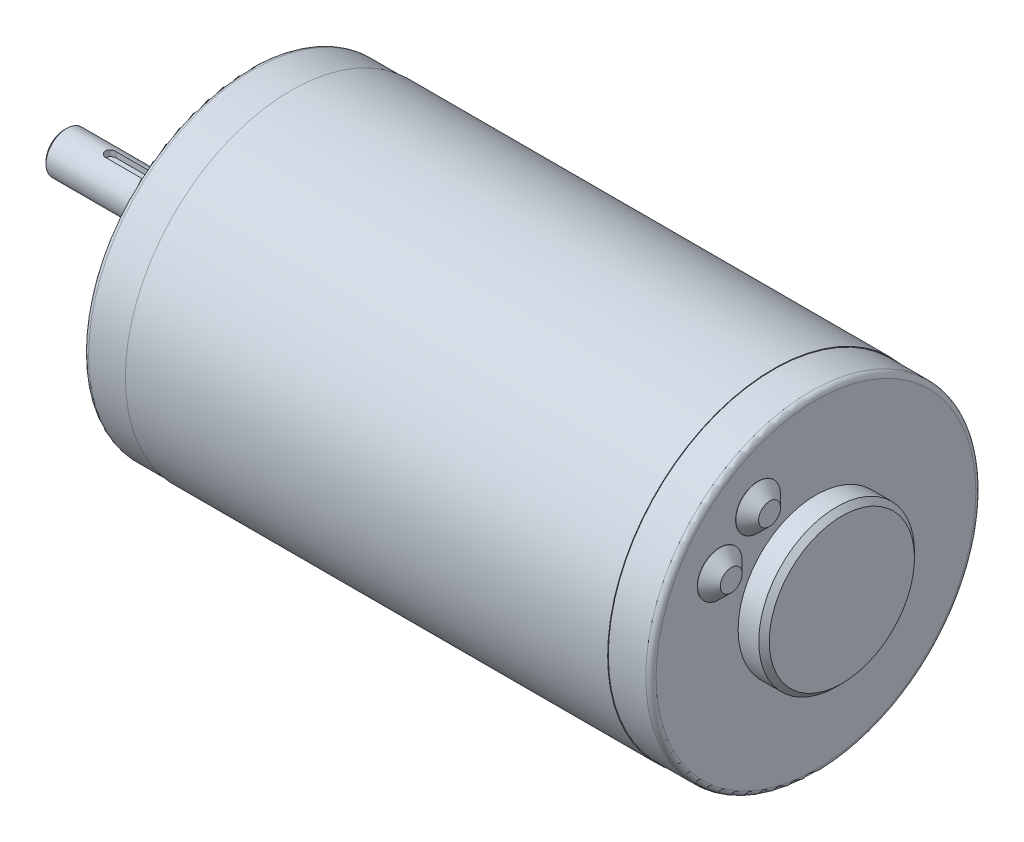
ISO-10303-21;
HEADER;
FILE_DESCRIPTION(('STEP AP214'),'2;1');
FILE_NAME('part.step','',(''),(''),'','','');
FILE_SCHEMA(('AUTOMOTIVE_DESIGN { 1 0 10303 214 1 1 1 1 }'));
ENDSEC;
DATA;
#1=APPLICATION_CONTEXT('core data for automotive mechanical design processes');
#2=APPLICATION_PROTOCOL_DEFINITION('international standard','automotive_design',2000,#1);
#3=PRODUCT_CONTEXT('',#1,'mechanical');
#4=PRODUCT('Part','Part','',(#3));
#5=PRODUCT_RELATED_PRODUCT_CATEGORY('part','',(#4));
#6=PRODUCT_DEFINITION_FORMATION('','',#4);
#7=PRODUCT_DEFINITION_CONTEXT('part definition',#1,'design');
#8=PRODUCT_DEFINITION('design','',#6,#7);
#9=PRODUCT_DEFINITION_SHAPE('','',#8);
#10=(LENGTH_UNIT() NAMED_UNIT(*) SI_UNIT(.MILLI.,.METRE.));
#11=(NAMED_UNIT(*) PLANE_ANGLE_UNIT() SI_UNIT($,.RADIAN.));
#12=(NAMED_UNIT(*) SI_UNIT($,.STERADIAN.) SOLID_ANGLE_UNIT());
#13=UNCERTAINTY_MEASURE_WITH_UNIT(LENGTH_MEASURE(1.E-05),#10,'distance_accuracy_value','');
#14=(GEOMETRIC_REPRESENTATION_CONTEXT(3) GLOBAL_UNCERTAINTY_ASSIGNED_CONTEXT((#13)) GLOBAL_UNIT_ASSIGNED_CONTEXT((#10,
#11,#12)) REPRESENTATION_CONTEXT('',''));
#15=CARTESIAN_POINT('',(0.,0.,0.));
#16=DIRECTION('',(0.,0.,1.));
#17=DIRECTION('',(1.,0.,0.));
#18=AXIS2_PLACEMENT_3D('',#15,#16,#17);
#19=CARTESIAN_POINT('',(-27.6,2.79999999999999,1.));
#20=DIRECTION('',(0.,-1.,0.));
#21=DIRECTION('',(0.,0.,1.));
#22=AXIS2_PLACEMENT_3D('',#19,#20,#21);
#23=PLANE('',#22);
#24=CARTESIAN_POINT('',(-7.1,2.79999999999999,0.));
#25=DIRECTION('',(0.,-1.,0.));
#26=DIRECTION('',(0.,0.,-1.));
#27=AXIS2_PLACEMENT_3D('',#24,#25,#26);
#28=CIRCLE('',#27,1.);
#29=CARTESIAN_POINT('',(-7.1,2.79999999999999,-1.));
#30=VERTEX_POINT('',#29);
#31=CARTESIAN_POINT('',(-7.1,2.79999999999999,1.));
#32=VERTEX_POINT('',#31);
#33=EDGE_CURVE('E109',#30,#32,#28,.T.);
#34=ORIENTED_EDGE('',*,*,#33,.F.);
#35=DIRECTION('',(1.,0.,0.));
#36=VECTOR('',#35,1.);
#37=CARTESIAN_POINT('',(-27.6,2.79999999999999,-1.));
#38=LINE('',#37,#36);
#39=CARTESIAN_POINT('',(-26.6,2.79999999999999,-1.));
#40=VERTEX_POINT('',#39);
#41=EDGE_CURVE('E121',#40,#30,#38,.T.);
#42=ORIENTED_EDGE('',*,*,#41,.F.);
#43=CARTESIAN_POINT('',(-26.6,2.79999999999999,0.));
#44=DIRECTION('',(0.,1.,0.));
#45=DIRECTION('',(0.,0.,1.));
#46=AXIS2_PLACEMENT_3D('',#43,#44,#45);
#47=CIRCLE('',#46,1.);
#48=CARTESIAN_POINT('',(-26.6,2.79999999999999,1.));
#49=VERTEX_POINT('',#48);
#50=EDGE_CURVE('E103',#49,#40,#47,.F.);
#51=ORIENTED_EDGE('',*,*,#50,.F.);
#52=DIRECTION('',(1.,0.,0.));
#53=VECTOR('',#52,1.);
#54=CARTESIAN_POINT('',(-27.6,2.79999999999999,1.));
#55=LINE('',#54,#53);
#56=EDGE_CURVE('E110',#49,#32,#55,.T.);
#57=ORIENTED_EDGE('',*,*,#56,.T.);
#58=EDGE_LOOP('',(#34,#42,#51,#57));
#59=FACE_BOUND('',#58,.T.);
#60=ADVANCED_FACE('F39',(#59),#23,.F.);
#61=CARTESIAN_POINT('',(-35.6,0.,0.));
#62=DIRECTION('',(-1.,0.,0.));
#63=DIRECTION('',(0.,0.,-1.));
#64=AXIS2_PLACEMENT_3D('',#61,#62,#63);
#65=PLANE('',#64);
#66=CARTESIAN_POINT('',(-35.6000000000449,0.,0.));
#67=DIRECTION('',(-1.,0.,0.));
#68=DIRECTION('',(0.,0.,1.));
#69=AXIS2_PLACEMENT_3D('',#66,#67,#68);
#70=CIRCLE('',#69,3.49999999997408);
#71=CARTESIAN_POINT('',(-35.6000000000449,0.,3.49999999997408));
#72=VERTEX_POINT('',#71);
#73=EDGE_CURVE('E260',#72,#72,#70,.T.);
#74=ORIENTED_EDGE('',*,*,#73,.T.);
#75=EDGE_LOOP('',(#74));
#76=FACE_BOUND('',#75,.T.);
#77=ADVANCED_FACE('F328',(#76),#65,.T.);
#78=CARTESIAN_POINT('',(-26.6,3.87298334620741,0.));
#79=DIRECTION('',(0.,-1.,0.));
#80=DIRECTION('',(0.,0.,1.));
#81=AXIS2_PLACEMENT_3D('',#78,#79,#80);
#82=CYLINDRICAL_SURFACE('',#81,1.);
#83=CARTESIAN_POINT('',(-26.6,3.87298334620741,-1.));
#84=CARTESIAN_POINT('',(-26.6276629851065,3.87298148580177,-1.00000033749611));
#85=CARTESIAN_POINT('',(-26.6553122630182,3.8732800994947,-0.998851407375366));
#86=CARTESIAN_POINT('',(-26.7104040353036,3.87445904774558,-0.994271295395754));
#87=CARTESIAN_POINT('',(-26.7378465636871,3.87533928441687,-0.99084049757268));
#88=CARTESIAN_POINT('',(-26.8194531732088,3.87881710972053,-0.977175239382527));
#89=CARTESIAN_POINT('',(-26.8730564684822,3.88225203148808,-0.963567695172493));
#90=CARTESIAN_POINT('',(-26.977124673782,3.89095422588002,-0.927798076247996));
#91=CARTESIAN_POINT('',(-27.0275898782129,3.89622132630929,-0.905636805423835));
#92=CARTESIAN_POINT('',(-27.1241114486473,3.90799134471939,-0.853415378025865));
#93=CARTESIAN_POINT('',(-27.170166627891,3.91449459395647,-0.823353103356933));
#94=CARTESIAN_POINT('',(-27.2575438819061,3.92816262398025,-0.755484471828068));
#95=CARTESIAN_POINT('',(-27.2987548862455,3.93533791028915,-0.717537268783974));
#96=CARTESIAN_POINT('',(-27.3743020894827,3.94945104396193,-0.635275780516228));
#97=CARTESIAN_POINT('',(-27.4086371894679,3.95638885322537,-0.590960479478829));
#98=CARTESIAN_POINT('',(-27.4699110016186,3.96936182283248,-0.496456899401689));
#99=CARTESIAN_POINT('',(-27.496739895984,3.9753830468173,-0.446195340334472));
#100=CARTESIAN_POINT('',(-27.5415247341967,3.98572346250588,-0.341702590842916));
#101=CARTESIAN_POINT('',(-27.5594824242998,3.990042989147,-0.287472184083007));
#102=CARTESIAN_POINT('',(-27.5856589927774,3.99641900005128,-0.177744108525158));
#103=CARTESIAN_POINT('',(-27.5940676724228,3.998519529013,-0.122294322002856));
#104=CARTESIAN_POINT('',(-27.6015033715433,4.00037438150815,-0.0107327756816783));
#105=CARTESIAN_POINT('',(-27.6005315701923,4.00012899993444,0.0453789000287066));
#106=CARTESIAN_POINT('',(-27.5893700363145,3.99735237365735,0.155352492972097));
#107=CARTESIAN_POINT('',(-27.5793853834005,3.9948719867736,0.209236701739855));
#108=CARTESIAN_POINT('',(-27.5508113208172,3.98796330636495,0.31453871108434));
#109=CARTESIAN_POINT('',(-27.5322215304314,3.98353492665556,0.365956402423988));
#110=CARTESIAN_POINT('',(-27.4867987193293,3.97314997761798,0.46540728602454));
#111=CARTESIAN_POINT('',(-27.4598926057672,3.96717993827555,0.513405629602248));
#112=CARTESIAN_POINT('',(-27.3986568701665,3.95435945541919,0.604276631230015));
#113=CARTESIAN_POINT('',(-27.3643261297468,3.94750887933198,0.64714851556229));
#114=CARTESIAN_POINT('',(-27.2881210879187,3.93345566022865,0.727769389708492));
#115=CARTESIAN_POINT('',(-27.2460683634602,3.92624850477685,0.765349103054128));
#116=CARTESIAN_POINT('',(-27.1561701330723,3.91246168284006,0.832969575186237));
#117=CARTESIAN_POINT('',(-27.1083230467164,3.90588218842993,0.863008270245062));
#118=CARTESIAN_POINT('',(-27.0078544021762,3.89407813586325,0.914804709285962));
#119=CARTESIAN_POINT('',(-26.9552085351039,3.88886106009136,0.936517017887269));
#120=CARTESIAN_POINT('',(-26.8468830715817,3.88047058807055,0.970702351849828));
#121=CARTESIAN_POINT('',(-26.7912081448502,3.87729413761435,0.983189189212132));
#122=CARTESIAN_POINT('',(-26.7125426192411,3.87455290681524,0.993904635150938));
#123=CARTESIAN_POINT('',(-26.6900802967868,3.87396523110859,0.996190790966708));
#124=CARTESIAN_POINT('',(-26.6450822100907,3.87318062488974,0.999236757697394));
#125=CARTESIAN_POINT('',(-26.6225466240447,3.87298306219461,0.999999038096045));
#126=CARTESIAN_POINT('',(-26.6,3.87298334620741,1.));
#127=B_SPLINE_CURVE_WITH_KNOTS('',3,(#83,#84,#85,#86,#87,#88,#89,#90,#91,#92,#93,#94,#95,#96,
#97,#98,#99,#100,#101,#102,#103,#104,#105,#106,#107,#108,#109,#110,#111,#112,#113,#114,#115,
#116,#117,#118,#119,#120,#121,#122,#123,#124,#125,#126),.UNSPECIFIED.,.F.,.F.,(4,2,2,2,2,2,2,2,
2,2,2,2,2,2,2,2,2,2,2,2,2,4),(0.,0.0829365303397693,0.16585910608465,0.331229963080318,
0.496585282091499,0.661984974726751,0.830641897427977,0.999325753539196,1.17036187098235,
1.34136430732425,1.50890481515325,1.67642426256639,1.84022545479276,2.00403389475838,
2.16932509450376,2.33464120964329,2.50441429534542,2.67423379180967,2.84496720161068,
3.01544447539986,3.08315848722648,3.15076267731671),.UNSPECIFIED.);
#128=CARTESIAN_POINT('',(-26.6,3.87298334620741,-1.));
#129=VERTEX_POINT('',#128);
#130=CARTESIAN_POINT('',(-26.6,3.87298334620741,1.));
#131=VERTEX_POINT('',#130);
#132=EDGE_CURVE('E106',#129,#131,#127,.T.);
#133=ORIENTED_EDGE('',*,*,#132,.T.);
#134=DIRECTION('',(0.,1.,0.));
#135=VECTOR('',#134,1.);
#136=CARTESIAN_POINT('',(-26.6,2.79999999999999,1.));
#137=LINE('',#136,#135);
#138=EDGE_CURVE('E98',#131,#49,#137,.F.);
#139=ORIENTED_EDGE('',*,*,#138,.T.);
#140=ORIENTED_EDGE('',*,*,#50,.T.);
#141=DIRECTION('',(0.,1.,0.));
#142=VECTOR('',#141,1.);
#143=CARTESIAN_POINT('',(-26.6,2.79999999999999,-1.));
#144=LINE('',#143,#142);
#145=EDGE_CURVE('E261',#129,#40,#144,.F.);
#146=ORIENTED_EDGE('',*,*,#145,.F.);
#147=EDGE_LOOP('',(#133,#139,#140,#146));
#148=FACE_BOUND('',#147,.T.);
#149=ADVANCED_FACE('F100',(#148),#82,.F.);
#150=CARTESIAN_POINT('',(-27.6,2.79999999999999,1.));
#151=DIRECTION('',(0.,0.,-1.));
#152=DIRECTION('',(1.,0.,0.));
#153=AXIS2_PLACEMENT_3D('',#150,#151,#152);
#154=PLANE('',#153);
#155=DIRECTION('',(1.,0.,0.));
#156=VECTOR('',#155,1.);
#157=CARTESIAN_POINT('',(0.,3.87298334620741,1.));
#158=LINE('',#157,#156);
#159=CARTESIAN_POINT('',(-7.1,3.87298334620741,1.));
#160=VERTEX_POINT('',#159);
#161=EDGE_CURVE('E252',#131,#160,#158,.T.);
#162=ORIENTED_EDGE('',*,*,#161,.T.);
#163=DIRECTION('',(0.,1.,0.));
#164=VECTOR('',#163,1.);
#165=CARTESIAN_POINT('',(-7.1,2.79999999999999,1.));
#166=LINE('',#165,#164);
#167=EDGE_CURVE('E115',#32,#160,#166,.T.);
#168=ORIENTED_EDGE('',*,*,#167,.F.);
#169=ORIENTED_EDGE('',*,*,#56,.F.);
#170=ORIENTED_EDGE('',*,*,#138,.F.);
#171=EDGE_LOOP('',(#162,#168,#169,#170));
#172=FACE_BOUND('',#171,.T.);
#173=ADVANCED_FACE('F113',(#172),#154,.T.);
#174=CARTESIAN_POINT('',(-7.1,2.79999999999999,0.));
#175=DIRECTION('',(0.,1.,0.));
#176=DIRECTION('',(0.,0.,-1.));
#177=AXIS2_PLACEMENT_3D('',#174,#175,#176);
#178=CYLINDRICAL_SURFACE('',#177,1.);
#179=ORIENTED_EDGE('',*,*,#33,.T.);
#180=ORIENTED_EDGE('',*,*,#167,.T.);
#181=CARTESIAN_POINT('',(-7.1,3.87298334620741,1.));
#182=CARTESIAN_POINT('',(-7.07233701489346,3.87298148580177,1.00000033749611));
#183=CARTESIAN_POINT('',(-7.04468773698177,3.8732800994947,0.998851407375366));
#184=CARTESIAN_POINT('',(-6.98959596469644,3.87445904774558,0.994271295395754));
#185=CARTESIAN_POINT('',(-6.96215343631291,3.87533928441687,0.990840497572679));
#186=CARTESIAN_POINT('',(-6.88054682679116,3.87881710972053,0.977175239382527));
#187=CARTESIAN_POINT('',(-6.82694353151779,3.88225203148808,0.963567695172494));
#188=CARTESIAN_POINT('',(-6.72287532621804,3.89095422588002,0.927798076247997));
#189=CARTESIAN_POINT('',(-6.67241012178715,3.89622132630929,0.905636805423836));
#190=CARTESIAN_POINT('',(-6.57588855135267,3.90799134471939,0.853415378025865));
#191=CARTESIAN_POINT('',(-6.52983337210904,3.91449459395647,0.823353103356933));
#192=CARTESIAN_POINT('',(-6.4424561180939,3.92816262398025,0.755484471828069));
#193=CARTESIAN_POINT('',(-6.40124511375448,3.93533791028915,0.717537268783976));
#194=CARTESIAN_POINT('',(-6.3256979105173,3.94945104396193,0.63527578051623));
#195=CARTESIAN_POINT('',(-6.29136281053206,3.95638885322537,0.590960479478831));
#196=CARTESIAN_POINT('',(-6.23008899838136,3.96936182283248,0.496456899401691));
#197=CARTESIAN_POINT('',(-6.20326010401603,3.9753830468173,0.446195340334474));
#198=CARTESIAN_POINT('',(-6.1584752658033,3.98572346250588,0.341702590842919));
#199=CARTESIAN_POINT('',(-6.14051757570017,3.990042989147,0.28747218408301));
#200=CARTESIAN_POINT('',(-6.11434100722257,3.99641900005128,0.17774410852516));
#201=CARTESIAN_POINT('',(-6.10593232757718,3.998519529013,0.122294322002858));
#202=CARTESIAN_POINT('',(-6.09849662845671,4.00037438150815,0.0107327756816796));
#203=CARTESIAN_POINT('',(-6.09946842980766,4.00012899993444,-0.0453789000287056));
#204=CARTESIAN_POINT('',(-6.11062996368545,3.99735237365735,-0.155352492972096));
#205=CARTESIAN_POINT('',(-6.12061461659948,3.9948719867736,-0.209236701739855));
#206=CARTESIAN_POINT('',(-6.14918867918275,3.98796330636495,-0.31453871108434));
#207=CARTESIAN_POINT('',(-6.16777846956858,3.98353492665556,-0.365956402423988));
#208=CARTESIAN_POINT('',(-6.21320128067065,3.97314997761798,-0.465407286024539));
#209=CARTESIAN_POINT('',(-6.24010739423284,3.96717993827555,-0.513405629602249));
#210=CARTESIAN_POINT('',(-6.30134312983347,3.95435945541919,-0.604276631230014));
#211=CARTESIAN_POINT('',(-6.33567387025322,3.94750887933198,-0.647148515562289));
#212=CARTESIAN_POINT('',(-6.41187891208131,3.93345566022865,-0.72776938970849));
#213=CARTESIAN_POINT('',(-6.45393163653982,3.92624850477685,-0.765349103054127));
#214=CARTESIAN_POINT('',(-6.54382986692774,3.91246168284006,-0.832969575186237));
#215=CARTESIAN_POINT('',(-6.59167695328356,3.90588218842993,-0.863008270245062));
#216=CARTESIAN_POINT('',(-6.69214559782377,3.89407813586325,-0.914804709285962));
#217=CARTESIAN_POINT('',(-6.74479146489609,3.88886106009136,-0.936517017887269));
#218=CARTESIAN_POINT('',(-6.85311692841829,3.88047058807055,-0.970702351849828));
#219=CARTESIAN_POINT('',(-6.90879185514984,3.87729413761435,-0.983189189212131));
#220=CARTESIAN_POINT('',(-6.98745738075891,3.87455290681524,-0.993904635150938));
#221=CARTESIAN_POINT('',(-7.00991970321318,3.87396523110859,-0.996190790966708));
#222=CARTESIAN_POINT('',(-7.05491778990932,3.87318062488974,-0.999236757697394));
#223=CARTESIAN_POINT('',(-7.07745337595529,3.8729830621946,-0.999999038096045));
#224=CARTESIAN_POINT('',(-7.1,3.87298334620741,-1.));
#225=B_SPLINE_CURVE_WITH_KNOTS('',3,(#181,#182,#183,#184,#185,#186,#187,#188,#189,#190,#191,
#192,#193,#194,#195,#196,#197,#198,#199,#200,#201,#202,#203,#204,#205,#206,#207,#208,#209,#210,
#211,#212,#213,#214,#215,#216,#217,#218,#219,#220,#221,#222,#223,#224),.UNSPECIFIED.,.F.,.F.,(4,
2,2,2,2,2,2,2,2,2,2,2,2,2,2,2,2,2,2,2,2,4),(0.,0.0829365303397684,0.165859106084651,
0.331229963080317,0.496585282091498,0.661984974726749,0.830641897427974,0.999325753539193,
1.17036187098235,1.34136430732424,1.50890481515325,1.67642426256639,1.84022545479276,
2.00403389475838,2.16932509450376,2.33464120964329,2.50441429534542,2.67423379180967,
2.84496720161068,3.01544447539986,3.08315848722648,3.15076267731671),.UNSPECIFIED.);
#226=CARTESIAN_POINT('',(-7.1,3.87298334620741,-1.));
#227=VERTEX_POINT('',#226);
#228=EDGE_CURVE('E251',#160,#227,#225,.T.);
#229=ORIENTED_EDGE('',*,*,#228,.T.);
#230=DIRECTION('',(0.,1.,0.));
#231=VECTOR('',#230,1.);
#232=CARTESIAN_POINT('',(-7.1,2.79999999999999,-1.));
#233=LINE('',#232,#231);
#234=EDGE_CURVE('E257',#30,#227,#233,.T.);
#235=ORIENTED_EDGE('',*,*,#234,.F.);
#236=EDGE_LOOP('',(#179,#180,#229,#235));
#237=FACE_BOUND('',#236,.T.);
#238=ADVANCED_FACE('F318',(#237),#178,.F.);
#239=CARTESIAN_POINT('',(-27.6,2.79999999999999,-1.));
#240=DIRECTION('',(0.,0.,-1.));
#241=DIRECTION('',(1.,0.,0.));
#242=AXIS2_PLACEMENT_3D('',#239,#240,#241);
#243=PLANE('',#242);
#244=ORIENTED_EDGE('',*,*,#234,.T.);
#245=DIRECTION('',(1.,0.,0.));
#246=VECTOR('',#245,1.);
#247=CARTESIAN_POINT('',(0.,3.87298334620741,-1.));
#248=LINE('',#247,#246);
#249=EDGE_CURVE('E248',#227,#129,#248,.F.);
#250=ORIENTED_EDGE('',*,*,#249,.T.);
#251=ORIENTED_EDGE('',*,*,#145,.T.);
#252=ORIENTED_EDGE('',*,*,#41,.T.);
#253=EDGE_LOOP('',(#244,#250,#251,#252));
#254=FACE_BOUND('',#253,.T.);
#255=ADVANCED_FACE('F323',(#254),#243,.F.);
#256=CARTESIAN_POINT('',(-35.0999999999999,0.,0.));
#257=DIRECTION('',(1.,0.,0.));
#258=DIRECTION('',(0.,0.,1.));
#259=AXIS2_PLACEMENT_3D('',#256,#257,#258);
#260=CONICAL_SURFACE('',#259,3.99999999996226,0.785398163340605);
#261=ORIENTED_EDGE('',*,*,#73,.F.);
#262=EDGE_LOOP('',(#261));
#263=FACE_BOUND('',#262,.T.);
#264=CARTESIAN_POINT('',(-35.1,0.,0.));
#265=DIRECTION('',(-1.,0.,0.));
#266=DIRECTION('',(0.,0.,1.));
#267=AXIS2_PLACEMENT_3D('',#264,#265,#266);
#268=CIRCLE('',#267,4.);
#269=CARTESIAN_POINT('',(-35.1,0.,4.));
#270=VERTEX_POINT('',#269);
#271=EDGE_CURVE('E250',#270,#270,#268,.T.);
#272=ORIENTED_EDGE('',*,*,#271,.T.);
#273=EDGE_LOOP('',(#272));
#274=FACE_BOUND('',#273,.T.);
#275=ADVANCED_FACE('F337',(#263,#274),#260,.T.);
#276=CARTESIAN_POINT('',(0.,0.,0.));
#277=DIRECTION('',(1.,0.,0.));
#278=DIRECTION('',(0.,0.,1.));
#279=AXIS2_PLACEMENT_3D('',#276,#277,#278);
#280=CYLINDRICAL_SURFACE('',#279,4.);
#281=ORIENTED_EDGE('',*,*,#271,.F.);
#282=EDGE_LOOP('',(#281));
#283=FACE_BOUND('',#282,.T.);
#284=CARTESIAN_POINT('',(-4.,0.,0.));
#285=DIRECTION('',(-1.,0.,0.));
#286=DIRECTION('',(0.,0.,1.));
#287=AXIS2_PLACEMENT_3D('',#284,#285,#286);
#288=CIRCLE('',#287,4.);
#289=CARTESIAN_POINT('',(-4.,0.,4.));
#290=VERTEX_POINT('',#289);
#291=EDGE_CURVE('E256',#290,#290,#288,.T.);
#292=ORIENTED_EDGE('',*,*,#291,.T.);
#293=EDGE_LOOP('',(#292));
#294=FACE_BOUND('',#293,.T.);
#295=ORIENTED_EDGE('',*,*,#228,.F.);
#296=ORIENTED_EDGE('',*,*,#161,.F.);
#297=ORIENTED_EDGE('',*,*,#132,.F.);
#298=ORIENTED_EDGE('',*,*,#249,.F.);
#299=EDGE_LOOP('',(#295,#296,#297,#298));
#300=FACE_BOUND('',#299,.T.);
#301=ADVANCED_FACE('F314',(#283,#294,#300),#280,.T.);
#302=CARTESIAN_POINT('',(-4.,4.,0.));
#303=DIRECTION('',(-1.,0.,0.));
#304=DIRECTION('',(0.,0.,-1.));
#305=AXIS2_PLACEMENT_3D('',#302,#303,#304);
#306=PLANE('',#305);
#307=ORIENTED_EDGE('',*,*,#291,.F.);
#308=EDGE_LOOP('',(#307));
#309=FACE_BOUND('',#308,.T.);
#310=CARTESIAN_POINT('',(-4.,0.,0.));
#311=DIRECTION('',(-1.,0.,0.));
#312=DIRECTION('',(0.,1.,0.));
#313=AXIS2_PLACEMENT_3D('',#310,#311,#312);
#314=CIRCLE('',#313,8.509);
#315=CARTESIAN_POINT('',(-4.,8.509,0.));
#316=VERTEX_POINT('',#315);
#317=EDGE_CURVE('E298',#316,#316,#314,.T.);
#318=ORIENTED_EDGE('',*,*,#317,.T.);
#319=EDGE_LOOP('',(#318));
#320=FACE_BOUND('',#319,.T.);
#321=ADVANCED_FACE('F344',(#309,#320),#306,.T.);
#322=CARTESIAN_POINT('',(111.8479,18.6070906828553,11.2073596390943));
#323=DIRECTION('',(1.,0.,0.));
#324=DIRECTION('',(0.,0.,1.));
#325=AXIS2_PLACEMENT_3D('',#322,#323,#324);
#326=PLANE('',#325);
#327=CARTESIAN_POINT('',(111.84789999993,18.6070906828553,11.2073596390943));
#328=DIRECTION('',(1.,0.,0.));
#329=DIRECTION('',(0.,-1.,0.));
#330=AXIS2_PLACEMENT_3D('',#327,#328,#329);
#331=CIRCLE('',#330,2.11800000003146);
#332=CARTESIAN_POINT('',(111.84789999993,16.4890906828238,11.2073596390943));
#333=VERTEX_POINT('',#332);
#334=EDGE_CURVE('E295',#333,#333,#331,.T.);
#335=ORIENTED_EDGE('',*,*,#334,.T.);
#336=EDGE_LOOP('',(#335));
#337=FACE_BOUND('',#336,.T.);
#338=ADVANCED_FACE('F367',(#337),#326,.T.);
#339=CARTESIAN_POINT('',(114.6,15.0368,0.));
#340=DIRECTION('',(1.,0.,0.));
#341=DIRECTION('',(0.,0.,1.));
#342=AXIS2_PLACEMENT_3D('',#339,#340,#341);
#343=PLANE('',#342);
#344=CARTESIAN_POINT('',(114.6,0.,0.));
#345=DIRECTION('',(1.,0.,0.));
#346=DIRECTION('',(0.,-1.,0.));
#347=AXIS2_PLACEMENT_3D('',#344,#345,#346);
#348=CIRCLE('',#347,14.0208);
#349=CARTESIAN_POINT('',(114.6,-14.0208,0.));
#350=VERTEX_POINT('',#349);
#351=EDGE_CURVE('E292',#350,#350,#348,.T.);
#352=ORIENTED_EDGE('',*,*,#351,.T.);
#353=EDGE_LOOP('',(#352));
#354=FACE_BOUND('',#353,.T.);
#355=ADVANCED_FACE('F374',(#354),#343,.T.);
#356=CARTESIAN_POINT('',(111.8479,11.2073596390943,18.6070906828553));
#357=DIRECTION('',(1.,0.,0.));
#358=DIRECTION('',(0.,0.,1.));
#359=AXIS2_PLACEMENT_3D('',#356,#357,#358);
#360=PLANE('',#359);
#361=CARTESIAN_POINT('',(111.84789999993,11.2073596390943,18.6070906828553));
#362=DIRECTION('',(1.,0.,0.));
#363=DIRECTION('',(0.,0.,-1.));
#364=AXIS2_PLACEMENT_3D('',#361,#362,#363);
#365=CIRCLE('',#364,2.1180000000021);
#366=CARTESIAN_POINT('',(111.84789999993,11.2073596390943,16.4890906828532));
#367=VERTEX_POINT('',#366);
#368=EDGE_CURVE('E247',#367,#367,#365,.T.);
#369=ORIENTED_EDGE('',*,*,#368,.T.);
#370=EDGE_LOOP('',(#369));
#371=FACE_BOUND('',#370,.T.);
#372=ADVANCED_FACE('F382',(#371),#360,.T.);
#373=CARTESIAN_POINT('',(13.6143999999945,25.4,0.));
#374=DIRECTION('',(-1.,0.,0.));
#375=DIRECTION('',(0.,0.,-1.));
#376=AXIS2_PLACEMENT_3D('',#373,#374,#375);
#377=CONICAL_SURFACE('',#376,2.01929999997219,1.02974425867198);
#378=CARTESIAN_POINT('',(14.827717847993,25.4,0.));
#379=VERTEX_POINT('',#378);
#380=VERTEX_LOOP('',#379);
#381=FACE_BOUND('',#380,.T.);
#382=CARTESIAN_POINT('',(13.6144,25.4,0.));
#383=DIRECTION('',(1.,0.,0.));
#384=DIRECTION('',(0.,0.,-1.));
#385=AXIS2_PLACEMENT_3D('',#382,#383,#384);
#386=CIRCLE('',#385,2.0193);
#387=CARTESIAN_POINT('',(13.6144,25.4,-2.0193));
#388=VERTEX_POINT('',#387);
#389=EDGE_CURVE('E244',#388,#388,#386,.T.);
#390=ORIENTED_EDGE('',*,*,#389,.F.);
#391=EDGE_LOOP('',(#390));
#392=FACE_BOUND('',#391,.T.);
#393=ADVANCED_FACE('F390',(#381,#392),#377,.F.);
#394=CARTESIAN_POINT('',(13.6143999999945,-25.4,0.));
#395=DIRECTION('',(-1.,0.,0.));
#396=DIRECTION('',(0.,0.,-1.));
#397=AXIS2_PLACEMENT_3D('',#394,#395,#396);
#398=CONICAL_SURFACE('',#397,2.01929999997219,1.02974425867198);
#399=CARTESIAN_POINT('',(14.827717847993,-25.4,0.));
#400=VERTEX_POINT('',#399);
#401=VERTEX_LOOP('',#400);
#402=FACE_BOUND('',#401,.T.);
#403=CARTESIAN_POINT('',(13.6144,-25.4,0.));
#404=DIRECTION('',(1.,0.,0.));
#405=DIRECTION('',(0.,0.,-1.));
#406=AXIS2_PLACEMENT_3D('',#403,#404,#405);
#407=CIRCLE('',#406,2.0193);
#408=CARTESIAN_POINT('',(13.6144,-25.4,-2.0193));
#409=VERTEX_POINT('',#408);
#410=EDGE_CURVE('E241',#409,#409,#407,.T.);
#411=ORIENTED_EDGE('',*,*,#410,.F.);
#412=EDGE_LOOP('',(#411));
#413=FACE_BOUND('',#412,.T.);
#414=ADVANCED_FACE('F398',(#402,#413),#398,.F.);
#415=CARTESIAN_POINT('',(-2.984,0.,0.));
#416=DIRECTION('',(1.,0.,0.));
#417=DIRECTION('',(0.,1.,0.));
#418=AXIS2_PLACEMENT_3D('',#415,#416,#417);
#419=CONICAL_SURFACE('',#418,9.525,0.78539816339745);
#420=ORIENTED_EDGE('',*,*,#317,.F.);
#421=EDGE_LOOP('',(#420));
#422=FACE_BOUND('',#421,.T.);
#423=CARTESIAN_POINT('',(-2.984,0.,0.));
#424=DIRECTION('',(-1.,0.,0.));
#425=DIRECTION('',(0.,0.,1.));
#426=AXIS2_PLACEMENT_3D('',#423,#424,#425);
#427=CIRCLE('',#426,9.525);
#428=CARTESIAN_POINT('',(-2.984,0.,9.525));
#429=VERTEX_POINT('',#428);
#430=EDGE_CURVE('E238',#429,#429,#427,.T.);
#431=ORIENTED_EDGE('',*,*,#430,.T.);
#432=EDGE_LOOP('',(#431));
#433=FACE_BOUND('',#432,.T.);
#434=ADVANCED_FACE('F406',(#422,#433),#419,.T.);
#435=CARTESIAN_POINT('',(109.647900000027,18.6070906828553,11.2073596390943));
#436=DIRECTION('',(-1.,0.,0.));
#437=DIRECTION('',(0.,-1.,0.));
#438=AXIS2_PLACEMENT_3D('',#435,#436,#437);
#439=CONICAL_SURFACE('',#438,4.31799999987712,0.785398163384529);
#440=CARTESIAN_POINT('',(109.6479,18.6070906828553,11.2073596390943));
#441=DIRECTION('',(1.,0.,0.));
#442=DIRECTION('',(0.,0.,-1.));
#443=AXIS2_PLACEMENT_3D('',#440,#441,#442);
#444=CIRCLE('',#443,4.318);
#445=CARTESIAN_POINT('',(109.6479,18.6070906828553,6.88935963909434));
#446=VERTEX_POINT('',#445);
#447=EDGE_CURVE('E235',#446,#446,#444,.T.);
#448=ORIENTED_EDGE('',*,*,#447,.T.);
#449=EDGE_LOOP('',(#448));
#450=FACE_BOUND('',#449,.T.);
#451=ORIENTED_EDGE('',*,*,#334,.F.);
#452=EDGE_LOOP('',(#451));
#453=FACE_BOUND('',#452,.T.);
#454=ADVANCED_FACE('F414',(#450,#453),#439,.T.);
#455=CARTESIAN_POINT('',(113.584,0.,0.));
#456=DIRECTION('',(-1.,0.,0.));
#457=DIRECTION('',(0.,-1.,0.));
#458=AXIS2_PLACEMENT_3D('',#455,#456,#457);
#459=CONICAL_SURFACE('',#458,15.0368,0.785398163397441);
#460=ORIENTED_EDGE('',*,*,#351,.F.);
#461=EDGE_LOOP('',(#460));
#462=FACE_BOUND('',#461,.T.);
#463=CARTESIAN_POINT('',(113.584,0.,0.));
#464=DIRECTION('',(-1.,0.,0.));
#465=DIRECTION('',(0.,0.,1.));
#466=AXIS2_PLACEMENT_3D('',#463,#464,#465);
#467=CIRCLE('',#466,15.0368);
#468=CARTESIAN_POINT('',(113.584,0.,15.0368));
#469=VERTEX_POINT('',#468);
#470=EDGE_CURVE('E232',#469,#469,#467,.F.);
#471=ORIENTED_EDGE('',*,*,#470,.T.);
#472=EDGE_LOOP('',(#471));
#473=FACE_BOUND('',#472,.T.);
#474=ADVANCED_FACE('F422',(#462,#473),#459,.T.);
#475=CARTESIAN_POINT('',(109.647900000084,11.2073596390943,18.6070906828553));
#476=DIRECTION('',(-1.,0.,0.));
#477=DIRECTION('',(0.,0.,-1.));
#478=AXIS2_PLACEMENT_3D('',#475,#476,#477);
#479=CONICAL_SURFACE('',#478,4.31799999990461,0.785398163410367);
#480=CARTESIAN_POINT('',(109.6479,11.2073596390943,18.6070906828553));
#481=DIRECTION('',(1.,0.,0.));
#482=DIRECTION('',(0.,0.,-1.));
#483=AXIS2_PLACEMENT_3D('',#480,#481,#482);
#484=CIRCLE('',#483,4.318);
#485=CARTESIAN_POINT('',(109.6479,11.2073596390943,14.2890906828553));
#486=VERTEX_POINT('',#485);
#487=EDGE_CURVE('E223',#486,#486,#484,.T.);
#488=ORIENTED_EDGE('',*,*,#487,.T.);
#489=EDGE_LOOP('',(#488));
#490=FACE_BOUND('',#489,.T.);
#491=ORIENTED_EDGE('',*,*,#368,.F.);
#492=EDGE_LOOP('',(#491));
#493=FACE_BOUND('',#492,.T.);
#494=ADVANCED_FACE('F430',(#490,#493),#479,.T.);
#495=CARTESIAN_POINT('',(0.,25.4,0.));
#496=DIRECTION('',(-1.,0.,0.));
#497=DIRECTION('',(0.,0.,-1.));
#498=AXIS2_PLACEMENT_3D('',#495,#496,#497);
#499=CYLINDRICAL_SURFACE('',#498,2.0193);
#500=CARTESIAN_POINT('',(0.,25.4,0.));
#501=DIRECTION('',(1.,0.,0.));
#502=DIRECTION('',(0.,0.,-1.));
#503=AXIS2_PLACEMENT_3D('',#500,#501,#502);
#504=CIRCLE('',#503,2.0193);
#505=CARTESIAN_POINT('',(0.,25.4,-2.0193));
#506=VERTEX_POINT('',#505);
#507=EDGE_CURVE('E231',#506,#506,#504,.F.);
#508=ORIENTED_EDGE('',*,*,#507,.T.);
#509=EDGE_LOOP('',(#508));
#510=FACE_BOUND('',#509,.T.);
#511=ORIENTED_EDGE('',*,*,#389,.T.);
#512=EDGE_LOOP('',(#511));
#513=FACE_BOUND('',#512,.T.);
#514=ADVANCED_FACE('F438',(#510,#513),#499,.F.);
#515=CARTESIAN_POINT('',(0.,-25.4,0.));
#516=DIRECTION('',(-1.,0.,0.));
#517=DIRECTION('',(0.,0.,-1.));
#518=AXIS2_PLACEMENT_3D('',#515,#516,#517);
#519=CYLINDRICAL_SURFACE('',#518,2.0193);
#520=CARTESIAN_POINT('',(0.,-25.4,0.));
#521=DIRECTION('',(1.,0.,0.));
#522=DIRECTION('',(0.,0.,-1.));
#523=AXIS2_PLACEMENT_3D('',#520,#521,#522);
#524=CIRCLE('',#523,2.0193);
#525=CARTESIAN_POINT('',(0.,-25.4,-2.0193));
#526=VERTEX_POINT('',#525);
#527=EDGE_CURVE('E285',#526,#526,#524,.F.);
#528=ORIENTED_EDGE('',*,*,#527,.T.);
#529=EDGE_LOOP('',(#528));
#530=FACE_BOUND('',#529,.T.);
#531=ORIENTED_EDGE('',*,*,#410,.T.);
#532=EDGE_LOOP('',(#531));
#533=FACE_BOUND('',#532,.T.);
#534=ADVANCED_FACE('F446',(#530,#533),#519,.F.);
#535=CARTESIAN_POINT('',(0.,0.,0.));
#536=DIRECTION('',(1.,0.,0.));
#537=DIRECTION('',(0.,0.,1.));
#538=AXIS2_PLACEMENT_3D('',#535,#536,#537);
#539=CYLINDRICAL_SURFACE('',#538,9.525);
#540=ORIENTED_EDGE('',*,*,#430,.F.);
#541=EDGE_LOOP('',(#540));
#542=FACE_BOUND('',#541,.T.);
#543=CARTESIAN_POINT('',(0.,0.,0.));
#544=DIRECTION('',(-1.,0.,0.));
#545=DIRECTION('',(0.,0.,1.));
#546=AXIS2_PLACEMENT_3D('',#543,#544,#545);
#547=CIRCLE('',#546,9.525);
#548=CARTESIAN_POINT('',(0.,0.,9.525));
#549=VERTEX_POINT('',#548);
#550=EDGE_CURVE('E282',#549,#549,#547,.T.);
#551=ORIENTED_EDGE('',*,*,#550,.T.);
#552=EDGE_LOOP('',(#551));
#553=FACE_BOUND('',#552,.T.);
#554=ADVANCED_FACE('F454',(#542,#553),#539,.T.);
#555=CARTESIAN_POINT('',(111.8479,18.6070906828553,11.2073596390943));
#556=DIRECTION('',(-1.,0.,0.));
#557=DIRECTION('',(0.,0.,-1.));
#558=AXIS2_PLACEMENT_3D('',#555,#556,#557);
#559=CYLINDRICAL_SURFACE('',#558,4.318);
#560=CARTESIAN_POINT('',(109.6,18.6070906828553,11.2073596390943));
#561=DIRECTION('',(1.,0.,0.));
#562=DIRECTION('',(0.,0.,-1.));
#563=AXIS2_PLACEMENT_3D('',#560,#561,#562);
#564=CIRCLE('',#563,4.318);
#565=CARTESIAN_POINT('',(109.6,18.6070906828553,6.88935963909434));
#566=VERTEX_POINT('',#565);
#567=EDGE_CURVE('E279',#566,#566,#564,.T.);
#568=ORIENTED_EDGE('',*,*,#567,.T.);
#569=EDGE_LOOP('',(#568));
#570=FACE_BOUND('',#569,.T.);
#571=ORIENTED_EDGE('',*,*,#447,.F.);
#572=EDGE_LOOP('',(#571));
#573=FACE_BOUND('',#572,.T.);
#574=ADVANCED_FACE('F462',(#570,#573),#559,.T.);
#575=CARTESIAN_POINT('',(0.,0.,0.));
#576=DIRECTION('',(1.,0.,0.));
#577=DIRECTION('',(0.,0.,1.));
#578=AXIS2_PLACEMENT_3D('',#575,#576,#577);
#579=CYLINDRICAL_SURFACE('',#578,15.0368);
#580=CARTESIAN_POINT('',(109.6,0.,0.));
#581=DIRECTION('',(-1.,0.,0.));
#582=DIRECTION('',(0.,0.,1.));
#583=AXIS2_PLACEMENT_3D('',#580,#581,#582);
#584=CIRCLE('',#583,15.0368);
#585=CARTESIAN_POINT('',(109.6,0.,15.0368));
#586=VERTEX_POINT('',#585);
#587=EDGE_CURVE('E276',#586,#586,#584,.F.);
#588=ORIENTED_EDGE('',*,*,#587,.T.);
#589=EDGE_LOOP('',(#588));
#590=FACE_BOUND('',#589,.T.);
#591=ORIENTED_EDGE('',*,*,#470,.F.);
#592=EDGE_LOOP('',(#591));
#593=FACE_BOUND('',#592,.T.);
#594=ADVANCED_FACE('F470',(#590,#593),#579,.T.);
#595=CARTESIAN_POINT('',(111.8479,11.2073596390943,18.6070906828553));
#596=DIRECTION('',(-1.,0.,0.));
#597=DIRECTION('',(0.,0.,-1.));
#598=AXIS2_PLACEMENT_3D('',#595,#596,#597);
#599=CYLINDRICAL_SURFACE('',#598,4.318);
#600=CARTESIAN_POINT('',(109.6,11.2073596390943,18.6070906828553));
#601=DIRECTION('',(1.,0.,0.));
#602=DIRECTION('',(0.,0.,-1.));
#603=AXIS2_PLACEMENT_3D('',#600,#601,#602);
#604=CIRCLE('',#603,4.318);
#605=CARTESIAN_POINT('',(109.6,11.2073596390943,14.2890906828553));
#606=VERTEX_POINT('',#605);
#607=EDGE_CURVE('E273',#606,#606,#604,.T.);
#608=ORIENTED_EDGE('',*,*,#607,.T.);
#609=EDGE_LOOP('',(#608));
#610=FACE_BOUND('',#609,.T.);
#611=ORIENTED_EDGE('',*,*,#487,.F.);
#612=EDGE_LOOP('',(#611));
#613=FACE_BOUND('',#612,.T.);
#614=ADVANCED_FACE('F478',(#610,#613),#599,.T.);
#615=CARTESIAN_POINT('',(0.,9.525,0.));
#616=DIRECTION('',(-1.,0.,0.));
#617=DIRECTION('',(0.,0.,-1.));
#618=AXIS2_PLACEMENT_3D('',#615,#616,#617);
#619=PLANE('',#618);
#620=ORIENTED_EDGE('',*,*,#550,.F.);
#621=EDGE_LOOP('',(#620));
#622=FACE_BOUND('',#621,.T.);
#623=CARTESIAN_POINT('',(0.,0.,0.));
#624=DIRECTION('',(1.,0.,0.));
#625=DIRECTION('',(0.,0.,-1.));
#626=AXIS2_PLACEMENT_3D('',#623,#624,#625);
#627=CIRCLE('',#626,30.877);
#628=CARTESIAN_POINT('',(0.,0.,30.877));
#629=VERTEX_POINT('',#628);
#630=CARTESIAN_POINT('',(0.,0.,-30.877));
#631=VERTEX_POINT('',#630);
#632=EDGE_CURVE('E199',#629,#631,#627,.F.);
#633=ORIENTED_EDGE('',*,*,#632,.T.);
#634=CARTESIAN_POINT('',(0.,0.,0.));
#635=DIRECTION('',(1.,0.,0.));
#636=DIRECTION('',(0.,0.,1.));
#637=AXIS2_PLACEMENT_3D('',#634,#635,#636);
#638=CIRCLE('',#637,30.877);
#639=EDGE_CURVE('E209',#631,#629,#638,.F.);
#640=ORIENTED_EDGE('',*,*,#639,.T.);
#641=EDGE_LOOP('',(#633,#640));
#642=FACE_BOUND('',#641,.T.);
#643=ORIENTED_EDGE('',*,*,#527,.F.);
#644=EDGE_LOOP('',(#643));
#645=FACE_BOUND('',#644,.T.);
#646=ORIENTED_EDGE('',*,*,#507,.F.);
#647=EDGE_LOOP('',(#646));
#648=FACE_BOUND('',#647,.T.);
#649=ADVANCED_FACE('F176',(#622,#642,#645,#648),#619,.T.);
#650=CARTESIAN_POINT('',(109.6,31.877,0.));
#651=DIRECTION('',(1.,0.,0.));
#652=DIRECTION('',(0.,0.,1.));
#653=AXIS2_PLACEMENT_3D('',#650,#651,#652);
#654=PLANE('',#653);
#655=ORIENTED_EDGE('',*,*,#607,.F.);
#656=EDGE_LOOP('',(#655));
#657=FACE_BOUND('',#656,.T.);
#658=ORIENTED_EDGE('',*,*,#587,.F.);
#659=EDGE_LOOP('',(#658));
#660=FACE_BOUND('',#659,.T.);
#661=CARTESIAN_POINT('',(109.6,0.,0.));
#662=DIRECTION('',(-1.,0.,0.));
#663=DIRECTION('',(0.,0.,1.));
#664=AXIS2_PLACEMENT_3D('',#661,#662,#663);
#665=CIRCLE('',#664,30.877);
#666=CARTESIAN_POINT('',(109.6,0.,-30.877));
#667=VERTEX_POINT('',#666);
#668=CARTESIAN_POINT('',(109.6,0.,30.877));
#669=VERTEX_POINT('',#668);
#670=EDGE_CURVE('E127',#667,#669,#665,.F.);
#671=ORIENTED_EDGE('',*,*,#670,.T.);
#672=CARTESIAN_POINT('',(109.6,0.,0.));
#673=DIRECTION('',(-1.,0.,0.));
#674=DIRECTION('',(0.,0.,-1.));
#675=AXIS2_PLACEMENT_3D('',#672,#673,#674);
#676=CIRCLE('',#675,30.877);
#677=EDGE_CURVE('E58',#669,#667,#676,.F.);
#678=ORIENTED_EDGE('',*,*,#677,.T.);
#679=EDGE_LOOP('',(#671,#678));
#680=FACE_BOUND('',#679,.T.);
#681=ORIENTED_EDGE('',*,*,#567,.F.);
#682=EDGE_LOOP('',(#681));
#683=FACE_BOUND('',#682,.T.);
#684=ADVANCED_FACE('F167',(#657,#660,#680,#683),#654,.T.);
#685=CARTESIAN_POINT('',(0.999999999999999,0.,0.));
#686=DIRECTION('',(-1.,0.,0.));
#687=DIRECTION('',(0.,0.,-1.));
#688=AXIS2_PLACEMENT_3D('',#685,#686,#687);
#689=TOROIDAL_SURFACE('',#688,30.877,1.);
#690=CARTESIAN_POINT('',(0.999999999999999,0.,0.));
#691=DIRECTION('',(-1.,0.,0.));
#692=DIRECTION('',(0.,0.,1.));
#693=AXIS2_PLACEMENT_3D('',#690,#691,#692);
#694=CIRCLE('',#693,31.877);
#695=CARTESIAN_POINT('',(0.999999999999999,0.,31.877));
#696=VERTEX_POINT('',#695);
#697=EDGE_CURVE('E157',#696,#696,#694,.T.);
#698=ORIENTED_EDGE('',*,*,#697,.T.);
#699=EDGE_LOOP('',(#698));
#700=FACE_BOUND('',#699,.T.);
#701=ORIENTED_EDGE('',*,*,#639,.F.);
#702=ORIENTED_EDGE('',*,*,#632,.F.);
#703=EDGE_LOOP('',(#701,#702));
#704=FACE_BOUND('',#703,.T.);
#705=ADVANCED_FACE('F143',(#700,#704),#689,.T.);
#706=CARTESIAN_POINT('',(108.6,0.,0.));
#707=DIRECTION('',(1.,0.,0.));
#708=DIRECTION('',(0.,0.,1.));
#709=AXIS2_PLACEMENT_3D('',#706,#707,#708);
#710=TOROIDAL_SURFACE('',#709,30.877,1.);
#711=CARTESIAN_POINT('',(108.6,0.,0.));
#712=DIRECTION('',(-1.,0.,0.));
#713=DIRECTION('',(0.,0.,1.));
#714=AXIS2_PLACEMENT_3D('',#711,#712,#713);
#715=CIRCLE('',#714,31.877);
#716=CARTESIAN_POINT('',(108.6,0.,31.877));
#717=VERTEX_POINT('',#716);
#718=EDGE_CURVE('E153',#717,#717,#715,.F.);
#719=ORIENTED_EDGE('',*,*,#718,.T.);
#720=EDGE_LOOP('',(#719));
#721=FACE_BOUND('',#720,.T.);
#722=ORIENTED_EDGE('',*,*,#677,.F.);
#723=ORIENTED_EDGE('',*,*,#670,.F.);
#724=EDGE_LOOP('',(#722,#723));
#725=FACE_BOUND('',#724,.T.);
#726=ADVANCED_FACE('F132',(#721,#725),#710,.T.);
#727=CARTESIAN_POINT('',(0.,0.,0.));
#728=DIRECTION('',(1.,0.,0.));
#729=DIRECTION('',(0.,0.,1.));
#730=AXIS2_PLACEMENT_3D('',#727,#728,#729);
#731=CYLINDRICAL_SURFACE('',#730,31.877);
#732=ORIENTED_EDGE('',*,*,#697,.F.);
#733=EDGE_LOOP('',(#732));
#734=FACE_BOUND('',#733,.T.);
#735=CARTESIAN_POINT('',(8.2296,0.,0.));
#736=DIRECTION('',(-1.,0.,0.));
#737=DIRECTION('',(0.,0.,1.));
#738=AXIS2_PLACEMENT_3D('',#735,#736,#737);
#739=CIRCLE('',#738,31.877);
#740=CARTESIAN_POINT('',(8.2296,0.,31.877));
#741=VERTEX_POINT('',#740);
#742=EDGE_CURVE('E156',#741,#741,#739,.T.);
#743=ORIENTED_EDGE('',*,*,#742,.T.);
#744=EDGE_LOOP('',(#743));
#745=FACE_BOUND('',#744,.T.);
#746=ADVANCED_FACE('F142',(#734,#745),#731,.T.);
#747=CARTESIAN_POINT('',(0.,0.,0.));
#748=DIRECTION('',(1.,0.,0.));
#749=DIRECTION('',(0.,0.,1.));
#750=AXIS2_PLACEMENT_3D('',#747,#748,#749);
#751=CYLINDRICAL_SURFACE('',#750,31.877);
#752=CARTESIAN_POINT('',(101.3704,0.,0.));
#753=DIRECTION('',(-1.,0.,0.));
#754=DIRECTION('',(0.,0.,1.));
#755=AXIS2_PLACEMENT_3D('',#752,#753,#754);
#756=CIRCLE('',#755,31.877);
#757=CARTESIAN_POINT('',(101.3704,0.,31.877));
#758=VERTEX_POINT('',#757);
#759=EDGE_CURVE('E268',#758,#758,#756,.F.);
#760=ORIENTED_EDGE('',*,*,#759,.T.);
#761=EDGE_LOOP('',(#760));
#762=FACE_BOUND('',#761,.T.);
#763=ORIENTED_EDGE('',*,*,#718,.F.);
#764=EDGE_LOOP('',(#763));
#765=FACE_BOUND('',#764,.T.);
#766=ADVANCED_FACE('F512',(#762,#765),#751,.T.);
#767=CARTESIAN_POINT('',(8.2296,31.877,0.));
#768=DIRECTION('',(-1.,0.,0.));
#769=DIRECTION('',(0.,0.,-1.));
#770=AXIS2_PLACEMENT_3D('',#767,#768,#769);
#771=PLANE('',#770);
#772=CARTESIAN_POINT('',(8.2296,0.,0.));
#773=DIRECTION('',(-1.,0.,0.));
#774=DIRECTION('',(0.,0.,1.));
#775=AXIS2_PLACEMENT_3D('',#772,#773,#774);
#776=CIRCLE('',#775,32.004);
#777=CARTESIAN_POINT('',(8.2296,0.,32.004));
#778=VERTEX_POINT('',#777);
#779=EDGE_CURVE('E50',#778,#778,#776,.T.);
#780=ORIENTED_EDGE('',*,*,#779,.T.);
#781=EDGE_LOOP('',(#780));
#782=FACE_BOUND('',#781,.T.);
#783=ORIENTED_EDGE('',*,*,#742,.F.);
#784=EDGE_LOOP('',(#783));
#785=FACE_BOUND('',#784,.T.);
#786=ADVANCED_FACE('F519',(#782,#785),#771,.T.);
#787=CARTESIAN_POINT('',(101.3704,32.004,0.));
#788=DIRECTION('',(1.,0.,0.));
#789=DIRECTION('',(0.,0.,1.));
#790=AXIS2_PLACEMENT_3D('',#787,#788,#789);
#791=PLANE('',#790);
#792=ORIENTED_EDGE('',*,*,#759,.F.);
#793=EDGE_LOOP('',(#792));
#794=FACE_BOUND('',#793,.T.);
#795=CARTESIAN_POINT('',(101.3704,0.,0.));
#796=DIRECTION('',(-1.,0.,0.));
#797=DIRECTION('',(0.,0.,1.));
#798=AXIS2_PLACEMENT_3D('',#795,#796,#797);
#799=CIRCLE('',#798,32.004);
#800=CARTESIAN_POINT('',(101.3704,0.,32.004));
#801=VERTEX_POINT('',#800);
#802=EDGE_CURVE('E11',#801,#801,#799,.F.);
#803=ORIENTED_EDGE('',*,*,#802,.T.);
#804=EDGE_LOOP('',(#803));
#805=FACE_BOUND('',#804,.T.);
#806=ADVANCED_FACE('F526',(#794,#805),#791,.T.);
#807=CARTESIAN_POINT('',(0.,0.,0.));
#808=DIRECTION('',(1.,0.,0.));
#809=DIRECTION('',(0.,0.,1.));
#810=AXIS2_PLACEMENT_3D('',#807,#808,#809);
#811=CYLINDRICAL_SURFACE('',#810,32.004);
#812=ORIENTED_EDGE('',*,*,#802,.F.);
#813=EDGE_LOOP('',(#812));
#814=FACE_BOUND('',#813,.T.);
#815=ORIENTED_EDGE('',*,*,#779,.F.);
#816=EDGE_LOOP('',(#815));
#817=FACE_BOUND('',#816,.T.);
#818=ADVANCED_FACE('F534',(#814,#817),#811,.T.);
#819=CLOSED_SHELL('',(#60,#77,#149,#173,#238,#255,#275,#301,#321,#338,#355,#372,#393,#414,#434,
#454,#474,#494,#514,#534,#554,#574,#594,#614,#649,#684,#705,#726,#746,#766,#786,#806,#818));
#820=MANIFOLD_SOLID_BREP('B2',#819);
#821=ADVANCED_BREP_SHAPE_REPRESENTATION('',(#18,#820),#14);
#822=SHAPE_DEFINITION_REPRESENTATION(#9,#821);
ENDSEC;
END-ISO-10303-21;
